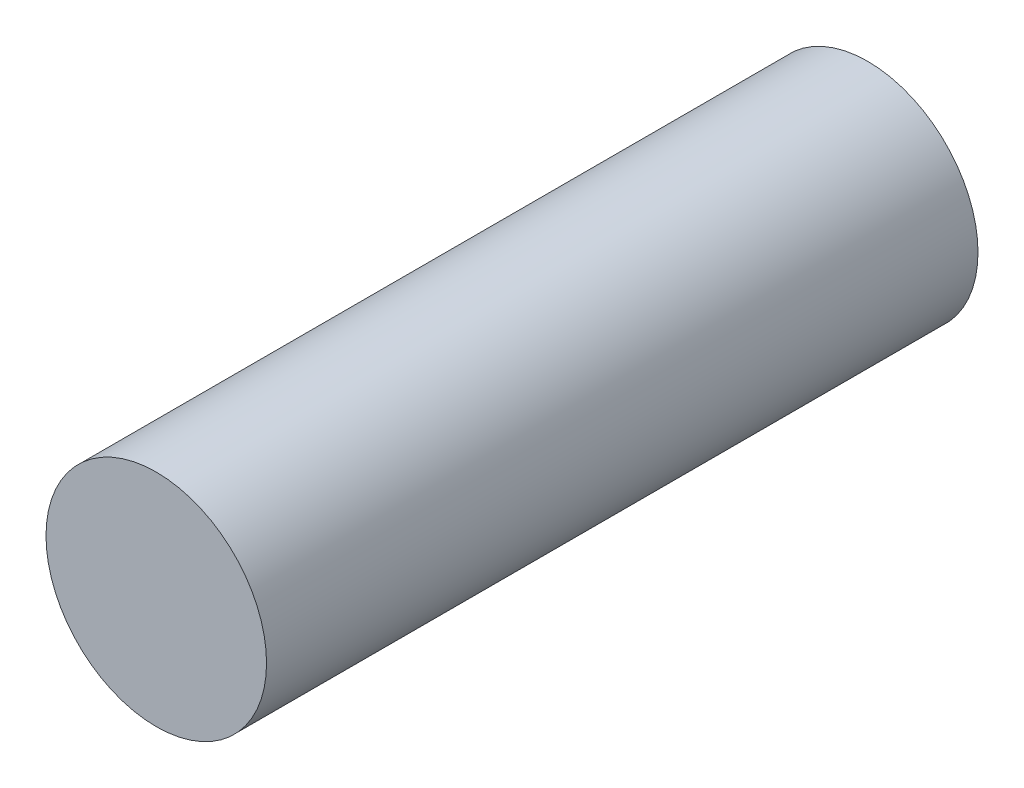
ISO-10303-21;
HEADER;
FILE_DESCRIPTION(('STEP AP214'),'2;1');
FILE_NAME('part.step','',(''),(''),'','','');
FILE_SCHEMA(('AUTOMOTIVE_DESIGN { 1 0 10303 214 1 1 1 1 }'));
ENDSEC;
DATA;
#1=APPLICATION_CONTEXT('core data for automotive mechanical design processes');
#2=APPLICATION_PROTOCOL_DEFINITION('international standard','automotive_design',2000,#1);
#3=PRODUCT_CONTEXT('',#1,'mechanical');
#4=PRODUCT('Part','Part','',(#3));
#5=PRODUCT_RELATED_PRODUCT_CATEGORY('part','',(#4));
#6=PRODUCT_DEFINITION_FORMATION('','',#4);
#7=PRODUCT_DEFINITION_CONTEXT('part definition',#1,'design');
#8=PRODUCT_DEFINITION('design','',#6,#7);
#9=PRODUCT_DEFINITION_SHAPE('','',#8);
#10=(LENGTH_UNIT() NAMED_UNIT(*) SI_UNIT(.MILLI.,.METRE.));
#11=(NAMED_UNIT(*) PLANE_ANGLE_UNIT() SI_UNIT($,.RADIAN.));
#12=(NAMED_UNIT(*) SI_UNIT($,.STERADIAN.) SOLID_ANGLE_UNIT());
#13=UNCERTAINTY_MEASURE_WITH_UNIT(LENGTH_MEASURE(1.E-05),#10,'distance_accuracy_value','');
#14=(GEOMETRIC_REPRESENTATION_CONTEXT(3) GLOBAL_UNCERTAINTY_ASSIGNED_CONTEXT((#13)) GLOBAL_UNIT_ASSIGNED_CONTEXT((#10,
#11,#12)) REPRESENTATION_CONTEXT('',''));
#15=CARTESIAN_POINT('',(0.,0.,0.));
#16=DIRECTION('',(0.,0.,1.));
#17=DIRECTION('',(1.,0.,0.));
#18=AXIS2_PLACEMENT_3D('',#15,#16,#17);
#19=CARTESIAN_POINT('',(0.,0.,50.));
#20=DIRECTION('',(0.,0.,-1.));
#21=DIRECTION('',(-1.,0.,0.));
#22=AXIS2_PLACEMENT_3D('',#19,#20,#21);
#23=CYLINDRICAL_SURFACE('',#22,7.75);
#24=CARTESIAN_POINT('',(0.,0.,50.));
#25=DIRECTION('',(0.,0.,1.));
#26=DIRECTION('',(1.,0.,0.));
#27=AXIS2_PLACEMENT_3D('',#24,#25,#26);
#28=CIRCLE('',#27,7.75);
#29=CARTESIAN_POINT('',(7.75,0.,50.));
#30=VERTEX_POINT('',#29);
#31=EDGE_CURVE('E10',#30,#30,#28,.T.);
#32=ORIENTED_EDGE('',*,*,#31,.F.);
#33=EDGE_LOOP('',(#32));
#34=FACE_BOUND('',#33,.T.);
#35=CARTESIAN_POINT('',(0.,0.,0.));
#36=DIRECTION('',(0.,0.,1.));
#37=DIRECTION('',(1.,0.,0.));
#38=AXIS2_PLACEMENT_3D('',#35,#36,#37);
#39=CIRCLE('',#38,7.75);
#40=CARTESIAN_POINT('',(7.75,0.,0.));
#41=VERTEX_POINT('',#40);
#42=EDGE_CURVE('E46',#41,#41,#39,.T.);
#43=ORIENTED_EDGE('',*,*,#42,.T.);
#44=EDGE_LOOP('',(#43));
#45=FACE_BOUND('',#44,.T.);
#46=ADVANCED_FACE('F43',(#34,#45),#23,.T.);
#47=CARTESIAN_POINT('',(0.,0.,50.));
#48=DIRECTION('',(0.,0.,1.));
#49=DIRECTION('',(1.,0.,0.));
#50=AXIS2_PLACEMENT_3D('',#47,#48,#49);
#51=PLANE('',#50);
#52=ORIENTED_EDGE('',*,*,#31,.T.);
#53=EDGE_LOOP('',(#52));
#54=FACE_BOUND('',#53,.T.);
#55=ADVANCED_FACE('F60',(#54),#51,.T.);
#56=CARTESIAN_POINT('',(0.,0.,0.));
#57=DIRECTION('',(0.,0.,1.));
#58=DIRECTION('',(1.,0.,0.));
#59=AXIS2_PLACEMENT_3D('',#56,#57,#58);
#60=PLANE('',#59);
#61=ORIENTED_EDGE('',*,*,#42,.F.);
#62=EDGE_LOOP('',(#61));
#63=FACE_BOUND('',#62,.T.);
#64=ADVANCED_FACE('F58',(#63),#60,.F.);
#65=CLOSED_SHELL('',(#46,#55,#64));
#66=MANIFOLD_SOLID_BREP('B2',#65);
#67=ADVANCED_BREP_SHAPE_REPRESENTATION('',(#18,#66),#14);
#68=SHAPE_DEFINITION_REPRESENTATION(#9,#67);
ENDSEC;
END-ISO-10303-21;
